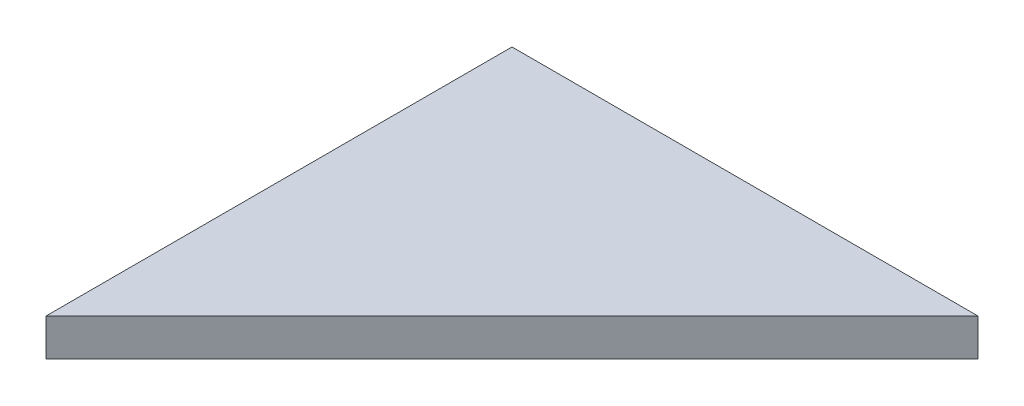
ISO-10303-21;
HEADER;
FILE_DESCRIPTION(('STEP AP214'),'2;1');
FILE_NAME('part.step','',(''),(''),'','','');
FILE_SCHEMA(('AUTOMOTIVE_DESIGN { 1 0 10303 214 1 1 1 1 }'));
ENDSEC;
DATA;
#1=APPLICATION_CONTEXT('core data for automotive mechanical design processes');
#2=APPLICATION_PROTOCOL_DEFINITION('international standard','automotive_design',2000,#1);
#3=PRODUCT_CONTEXT('',#1,'mechanical');
#4=PRODUCT('Part','Part','',(#3));
#5=PRODUCT_RELATED_PRODUCT_CATEGORY('part','',(#4));
#6=PRODUCT_DEFINITION_FORMATION('','',#4);
#7=PRODUCT_DEFINITION_CONTEXT('part definition',#1,'design');
#8=PRODUCT_DEFINITION('design','',#6,#7);
#9=PRODUCT_DEFINITION_SHAPE('','',#8);
#10=(LENGTH_UNIT() NAMED_UNIT(*) SI_UNIT(.MILLI.,.METRE.));
#11=(NAMED_UNIT(*) PLANE_ANGLE_UNIT() SI_UNIT($,.RADIAN.));
#12=(NAMED_UNIT(*) SI_UNIT($,.STERADIAN.) SOLID_ANGLE_UNIT());
#13=UNCERTAINTY_MEASURE_WITH_UNIT(LENGTH_MEASURE(1.E-05),#10,'distance_accuracy_value','');
#14=(GEOMETRIC_REPRESENTATION_CONTEXT(3) GLOBAL_UNCERTAINTY_ASSIGNED_CONTEXT((#13)) GLOBAL_UNIT_ASSIGNED_CONTEXT((#10,
#11,#12)) REPRESENTATION_CONTEXT('',''));
#15=CARTESIAN_POINT('',(0.,0.,0.));
#16=DIRECTION('',(0.,0.,1.));
#17=DIRECTION('',(1.,0.,0.));
#18=AXIS2_PLACEMENT_3D('',#15,#16,#17);
#19=CARTESIAN_POINT('',(0.,6.4,0.));
#20=DIRECTION('',(0.,1.,0.));
#21=DIRECTION('',(0.,0.,1.));
#22=AXIS2_PLACEMENT_3D('',#19,#20,#21);
#23=PLANE('',#22);
#24=DIRECTION('',(0.,0.,1.));
#25=VECTOR('',#24,1.);
#26=CARTESIAN_POINT('',(0.,6.4,0.));
#27=LINE('',#26,#25);
#28=CARTESIAN_POINT('',(0.,6.4,-20.));
#29=VERTEX_POINT('',#28);
#30=CARTESIAN_POINT('',(0.,6.4,-100.));
#31=VERTEX_POINT('',#30);
#32=EDGE_CURVE('E19',#29,#31,#27,.F.);
#33=ORIENTED_EDGE('',*,*,#32,.F.);
#34=DIRECTION('',(-0.707106781186548,0.,0.707106781186548));
#35=VECTOR('',#34,1.);
#36=CARTESIAN_POINT('',(-10.,6.4,-10.));
#37=LINE('',#36,#35);
#38=CARTESIAN_POINT('',(80.,6.4,-100.));
#39=VERTEX_POINT('',#38);
#40=EDGE_CURVE('E53',#29,#39,#37,.F.);
#41=ORIENTED_EDGE('',*,*,#40,.T.);
#42=DIRECTION('',(-1.,0.,0.));
#43=VECTOR('',#42,1.);
#44=CARTESIAN_POINT('',(0.,6.4,-100.));
#45=LINE('',#44,#43);
#46=EDGE_CURVE('E54',#31,#39,#45,.F.);
#47=ORIENTED_EDGE('',*,*,#46,.F.);
#48=EDGE_LOOP('',(#33,#41,#47));
#49=FACE_BOUND('',#48,.T.);
#50=ADVANCED_FACE('F16',(#49),#23,.T.);
#51=CARTESIAN_POINT('',(0.,6.4,0.));
#52=DIRECTION('',(-1.,0.,0.));
#53=DIRECTION('',(0.,0.,1.));
#54=AXIS2_PLACEMENT_3D('',#51,#52,#53);
#55=PLANE('',#54);
#56=ORIENTED_EDGE('',*,*,#32,.T.);
#57=DIRECTION('',(0.,1.,0.));
#58=VECTOR('',#57,1.);
#59=CARTESIAN_POINT('',(0.,6.4,-100.));
#60=LINE('',#59,#58);
#61=CARTESIAN_POINT('',(0.,0.,-100.));
#62=VERTEX_POINT('',#61);
#63=EDGE_CURVE('E60',#62,#31,#60,.T.);
#64=ORIENTED_EDGE('',*,*,#63,.F.);
#65=DIRECTION('',(0.,0.,1.));
#66=VECTOR('',#65,1.);
#67=CARTESIAN_POINT('',(0.,0.,0.));
#68=LINE('',#67,#66);
#69=CARTESIAN_POINT('',(0.,0.,-20.));
#70=VERTEX_POINT('',#69);
#71=EDGE_CURVE('E64',#62,#70,#68,.T.);
#72=ORIENTED_EDGE('',*,*,#71,.T.);
#73=DIRECTION('',(0.,1.,0.));
#74=VECTOR('',#73,1.);
#75=CARTESIAN_POINT('',(0.,6.4,-20.));
#76=LINE('',#75,#74);
#77=EDGE_CURVE('E55',#70,#29,#76,.T.);
#78=ORIENTED_EDGE('',*,*,#77,.T.);
#79=EDGE_LOOP('',(#56,#64,#72,#78));
#80=FACE_BOUND('',#79,.T.);
#81=ADVANCED_FACE('F63',(#80),#55,.T.);
#82=CARTESIAN_POINT('',(-10.,6.4,-10.));
#83=DIRECTION('',(-0.707106781186548,0.,-0.707106781186548));
#84=DIRECTION('',(-0.707106781186548,0.,0.707106781186548));
#85=AXIS2_PLACEMENT_3D('',#82,#83,#84);
#86=PLANE('',#85);
#87=DIRECTION('',(0.,1.,0.));
#88=VECTOR('',#87,1.);
#89=CARTESIAN_POINT('',(80.,6.4,-100.));
#90=LINE('',#89,#88);
#91=CARTESIAN_POINT('',(80.,0.,-100.));
#92=VERTEX_POINT('',#91);
#93=EDGE_CURVE('E33',#39,#92,#90,.F.);
#94=ORIENTED_EDGE('',*,*,#93,.F.);
#95=ORIENTED_EDGE('',*,*,#40,.F.);
#96=ORIENTED_EDGE('',*,*,#77,.F.);
#97=DIRECTION('',(0.707106781186548,0.,-0.707106781186547));
#98=VECTOR('',#97,1.);
#99=CARTESIAN_POINT('',(0.,0.,-20.));
#100=LINE('',#99,#98);
#101=EDGE_CURVE('E25',#70,#92,#100,.T.);
#102=ORIENTED_EDGE('',*,*,#101,.T.);
#103=EDGE_LOOP('',(#94,#95,#96,#102));
#104=FACE_BOUND('',#103,.T.);
#105=ADVANCED_FACE('F57',(#104),#86,.F.);
#106=CARTESIAN_POINT('',(0.,6.4,-100.));
#107=DIRECTION('',(0.,0.,-1.));
#108=DIRECTION('',(-1.,0.,0.));
#109=AXIS2_PLACEMENT_3D('',#106,#107,#108);
#110=PLANE('',#109);
#111=ORIENTED_EDGE('',*,*,#46,.T.);
#112=ORIENTED_EDGE('',*,*,#93,.T.);
#113=DIRECTION('',(1.,0.,0.));
#114=VECTOR('',#113,1.);
#115=CARTESIAN_POINT('',(0.,0.,-100.));
#116=LINE('',#115,#114);
#117=EDGE_CURVE('E10',#92,#62,#116,.F.);
#118=ORIENTED_EDGE('',*,*,#117,.T.);
#119=ORIENTED_EDGE('',*,*,#63,.T.);
#120=EDGE_LOOP('',(#111,#112,#118,#119));
#121=FACE_BOUND('',#120,.T.);
#122=ADVANCED_FACE('F72',(#121),#110,.T.);
#123=CARTESIAN_POINT('',(0.,0.,0.));
#124=DIRECTION('',(0.,1.,0.));
#125=DIRECTION('',(0.,0.,1.));
#126=AXIS2_PLACEMENT_3D('',#123,#124,#125);
#127=PLANE('',#126);
#128=ORIENTED_EDGE('',*,*,#101,.F.);
#129=ORIENTED_EDGE('',*,*,#71,.F.);
#130=ORIENTED_EDGE('',*,*,#117,.F.);
#131=EDGE_LOOP('',(#128,#129,#130));
#132=FACE_BOUND('',#131,.T.);
#133=ADVANCED_FACE('F71',(#132),#127,.F.);
#134=CLOSED_SHELL('',(#50,#81,#105,#122,#133));
#135=MANIFOLD_SOLID_BREP('B1',#134);
#136=ADVANCED_BREP_SHAPE_REPRESENTATION('',(#18,#135),#14);
#137=SHAPE_DEFINITION_REPRESENTATION(#9,#136);
ENDSEC;
END-ISO-10303-21;
